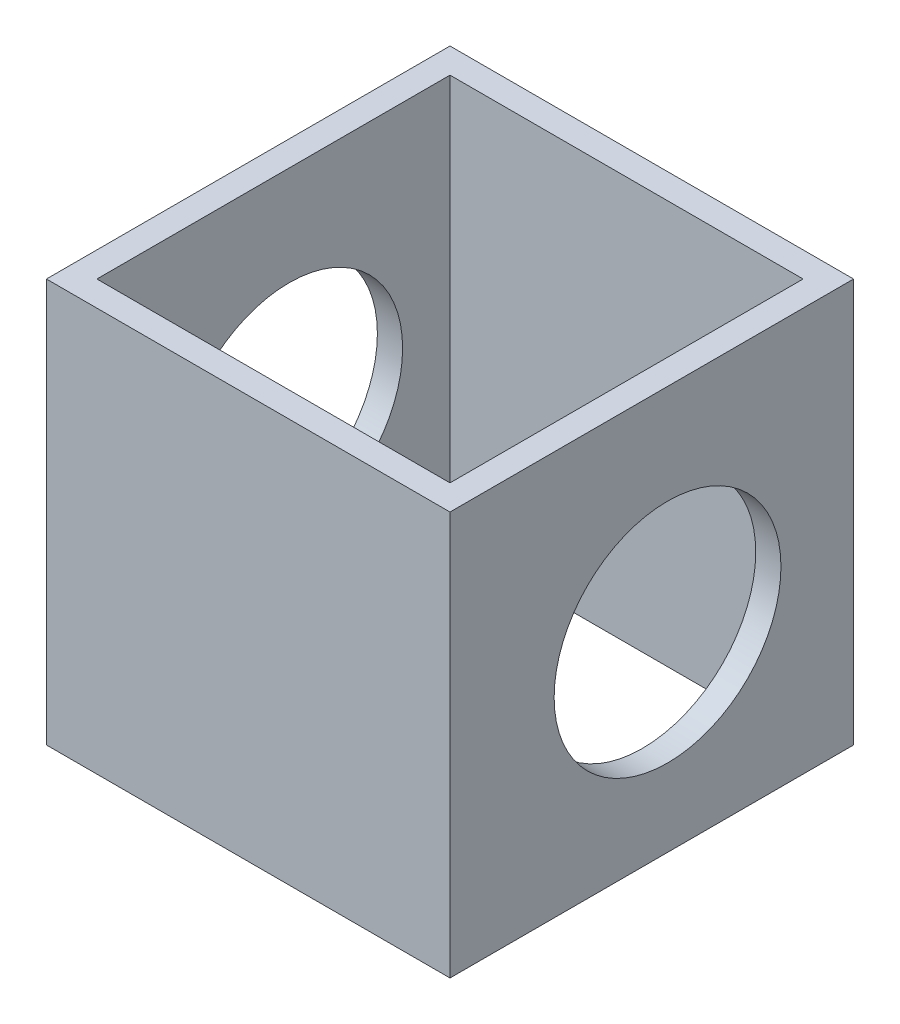
ISO-10303-21;
HEADER;
FILE_DESCRIPTION(('STEP AP214'),'2;1');
FILE_NAME('part.step','',(''),(''),'','','');
FILE_SCHEMA(('AUTOMOTIVE_DESIGN { 1 0 10303 214 1 1 1 1 }'));
ENDSEC;
DATA;
#1=APPLICATION_CONTEXT('core data for automotive mechanical design processes');
#2=APPLICATION_PROTOCOL_DEFINITION('international standard','automotive_design',2000,#1);
#3=PRODUCT_CONTEXT('',#1,'mechanical');
#4=PRODUCT('Part','Part','',(#3));
#5=PRODUCT_RELATED_PRODUCT_CATEGORY('part','',(#4));
#6=PRODUCT_DEFINITION_FORMATION('','',#4);
#7=PRODUCT_DEFINITION_CONTEXT('part definition',#1,'design');
#8=PRODUCT_DEFINITION('design','',#6,#7);
#9=PRODUCT_DEFINITION_SHAPE('','',#8);
#10=(LENGTH_UNIT() NAMED_UNIT(*) SI_UNIT(.MILLI.,.METRE.));
#11=(NAMED_UNIT(*) PLANE_ANGLE_UNIT() SI_UNIT($,.RADIAN.));
#12=(NAMED_UNIT(*) SI_UNIT($,.STERADIAN.) SOLID_ANGLE_UNIT());
#13=UNCERTAINTY_MEASURE_WITH_UNIT(LENGTH_MEASURE(1.E-05),#10,'distance_accuracy_value','');
#14=(GEOMETRIC_REPRESENTATION_CONTEXT(3) GLOBAL_UNCERTAINTY_ASSIGNED_CONTEXT((#13)) GLOBAL_UNIT_ASSIGNED_CONTEXT((#10,
#11,#12)) REPRESENTATION_CONTEXT('',''));
#15=CARTESIAN_POINT('',(0.,0.,0.));
#16=DIRECTION('',(0.,0.,1.));
#17=DIRECTION('',(1.,0.,0.));
#18=AXIS2_PLACEMENT_3D('',#15,#16,#17);
#19=CARTESIAN_POINT('',(0.,50.8,0.));
#20=DIRECTION('',(0.,1.,0.));
#21=DIRECTION('',(0.,0.,1.));
#22=AXIS2_PLACEMENT_3D('',#19,#20,#21);
#23=PLANE('',#22);
#24=DIRECTION('',(0.,0.,-1.));
#25=VECTOR('',#24,1.);
#26=CARTESIAN_POINT('',(25.4,50.8,25.4));
#27=LINE('',#26,#25);
#28=CARTESIAN_POINT('',(25.4,50.8,25.4));
#29=VERTEX_POINT('',#28);
#30=CARTESIAN_POINT('',(25.4,50.8,-25.4));
#31=VERTEX_POINT('',#30);
#32=EDGE_CURVE('E161',#29,#31,#27,.T.);
#33=ORIENTED_EDGE('',*,*,#32,.T.);
#34=DIRECTION('',(-1.,0.,0.));
#35=VECTOR('',#34,1.);
#36=CARTESIAN_POINT('',(-25.4,50.8,-25.4));
#37=LINE('',#36,#35);
#38=CARTESIAN_POINT('',(-25.4,50.8,-25.4));
#39=VERTEX_POINT('',#38);
#40=EDGE_CURVE('E164',#31,#39,#37,.T.);
#41=ORIENTED_EDGE('',*,*,#40,.T.);
#42=DIRECTION('',(0.,0.,1.));
#43=VECTOR('',#42,1.);
#44=CARTESIAN_POINT('',(-25.4,50.8,25.4));
#45=LINE('',#44,#43);
#46=CARTESIAN_POINT('',(-25.4,50.8,25.4));
#47=VERTEX_POINT('',#46);
#48=EDGE_CURVE('E167',#39,#47,#45,.T.);
#49=ORIENTED_EDGE('',*,*,#48,.T.);
#50=DIRECTION('',(1.,0.,0.));
#51=VECTOR('',#50,1.);
#52=CARTESIAN_POINT('',(-25.4,50.8,25.4));
#53=LINE('',#52,#51);
#54=EDGE_CURVE('E169',#47,#29,#53,.T.);
#55=ORIENTED_EDGE('',*,*,#54,.T.);
#56=EDGE_LOOP('',(#33,#41,#49,#55));
#57=FACE_BOUND('',#56,.T.);
#58=DIRECTION('',(-1.,0.,0.));
#59=VECTOR('',#58,1.);
#60=CARTESIAN_POINT('',(0.,50.8,-22.225));
#61=LINE('',#60,#59);
#62=CARTESIAN_POINT('',(22.225,50.8,-22.225));
#63=VERTEX_POINT('',#62);
#64=CARTESIAN_POINT('',(-22.225,50.8,-22.225));
#65=VERTEX_POINT('',#64);
#66=EDGE_CURVE('E131',#63,#65,#61,.T.);
#67=ORIENTED_EDGE('',*,*,#66,.F.);
#68=DIRECTION('',(0.,0.,-1.));
#69=VECTOR('',#68,1.);
#70=CARTESIAN_POINT('',(22.225,50.8,0.));
#71=LINE('',#70,#69);
#72=CARTESIAN_POINT('',(22.225,50.8,22.225));
#73=VERTEX_POINT('',#72);
#74=EDGE_CURVE('E123',#73,#63,#71,.T.);
#75=ORIENTED_EDGE('',*,*,#74,.F.);
#76=DIRECTION('',(1.,0.,0.));
#77=VECTOR('',#76,1.);
#78=CARTESIAN_POINT('',(0.,50.8,22.225));
#79=LINE('',#78,#77);
#80=CARTESIAN_POINT('',(-22.225,50.8,22.225));
#81=VERTEX_POINT('',#80);
#82=EDGE_CURVE('E145',#81,#73,#79,.T.);
#83=ORIENTED_EDGE('',*,*,#82,.F.);
#84=DIRECTION('',(0.,0.,1.));
#85=VECTOR('',#84,1.);
#86=CARTESIAN_POINT('',(-22.225,50.8,0.));
#87=LINE('',#86,#85);
#88=EDGE_CURVE('E143',#65,#81,#87,.T.);
#89=ORIENTED_EDGE('',*,*,#88,.F.);
#90=EDGE_LOOP('',(#67,#75,#83,#89));
#91=FACE_BOUND('',#90,.T.);
#92=ADVANCED_FACE('F57',(#57,#91),#23,.T.);
#93=CARTESIAN_POINT('',(0.,0.,0.));
#94=DIRECTION('',(0.,1.,0.));
#95=DIRECTION('',(0.,0.,1.));
#96=AXIS2_PLACEMENT_3D('',#93,#94,#95);
#97=PLANE('',#96);
#98=DIRECTION('',(0.,0.,-1.));
#99=VECTOR('',#98,1.);
#100=CARTESIAN_POINT('',(25.4,0.,25.4));
#101=LINE('',#100,#99);
#102=CARTESIAN_POINT('',(25.4,0.,25.4));
#103=VERTEX_POINT('',#102);
#104=CARTESIAN_POINT('',(25.4,0.,-25.4));
#105=VERTEX_POINT('',#104);
#106=EDGE_CURVE('E139',#103,#105,#101,.T.);
#107=ORIENTED_EDGE('',*,*,#106,.F.);
#108=DIRECTION('',(1.,0.,0.));
#109=VECTOR('',#108,1.);
#110=CARTESIAN_POINT('',(-25.4,0.,25.4));
#111=LINE('',#110,#109);
#112=CARTESIAN_POINT('',(-25.4,0.,25.4));
#113=VERTEX_POINT('',#112);
#114=EDGE_CURVE('E165',#113,#103,#111,.T.);
#115=ORIENTED_EDGE('',*,*,#114,.F.);
#116=DIRECTION('',(0.,0.,1.));
#117=VECTOR('',#116,1.);
#118=CARTESIAN_POINT('',(-25.4,0.,25.4));
#119=LINE('',#118,#117);
#120=CARTESIAN_POINT('',(-25.4,0.,-25.4));
#121=VERTEX_POINT('',#120);
#122=EDGE_CURVE('E176',#121,#113,#119,.T.);
#123=ORIENTED_EDGE('',*,*,#122,.F.);
#124=DIRECTION('',(-1.,0.,0.));
#125=VECTOR('',#124,1.);
#126=CARTESIAN_POINT('',(-25.4,0.,-25.4));
#127=LINE('',#126,#125);
#128=EDGE_CURVE('E174',#105,#121,#127,.T.);
#129=ORIENTED_EDGE('',*,*,#128,.F.);
#130=EDGE_LOOP('',(#107,#115,#123,#129));
#131=FACE_BOUND('',#130,.T.);
#132=DIRECTION('',(0.,0.,-1.));
#133=VECTOR('',#132,1.);
#134=CARTESIAN_POINT('',(22.225,0.,0.));
#135=LINE('',#134,#133);
#136=CARTESIAN_POINT('',(22.225,0.,22.225));
#137=VERTEX_POINT('',#136);
#138=CARTESIAN_POINT('',(22.225,0.,-22.225));
#139=VERTEX_POINT('',#138);
#140=EDGE_CURVE('E81',#137,#139,#135,.T.);
#141=ORIENTED_EDGE('',*,*,#140,.T.);
#142=DIRECTION('',(-1.,0.,0.));
#143=VECTOR('',#142,1.);
#144=CARTESIAN_POINT('',(0.,0.,-22.225));
#145=LINE('',#144,#143);
#146=CARTESIAN_POINT('',(-22.225,0.,-22.225));
#147=VERTEX_POINT('',#146);
#148=EDGE_CURVE('E138',#139,#147,#145,.T.);
#149=ORIENTED_EDGE('',*,*,#148,.T.);
#150=DIRECTION('',(0.,0.,1.));
#151=VECTOR('',#150,1.);
#152=CARTESIAN_POINT('',(-22.225,0.,0.));
#153=LINE('',#152,#151);
#154=CARTESIAN_POINT('',(-22.225,0.,22.225));
#155=VERTEX_POINT('',#154);
#156=EDGE_CURVE('E153',#147,#155,#153,.T.);
#157=ORIENTED_EDGE('',*,*,#156,.T.);
#158=DIRECTION('',(1.,0.,0.));
#159=VECTOR('',#158,1.);
#160=CARTESIAN_POINT('',(0.,0.,22.225));
#161=LINE('',#160,#159);
#162=EDGE_CURVE('E132',#155,#137,#161,.T.);
#163=ORIENTED_EDGE('',*,*,#162,.T.);
#164=EDGE_LOOP('',(#141,#149,#157,#163));
#165=FACE_BOUND('',#164,.T.);
#166=ADVANCED_FACE('F195',(#131,#165),#97,.F.);
#167=CARTESIAN_POINT('',(25.4,50.8,25.4));
#168=DIRECTION('',(-1.,0.,0.));
#169=DIRECTION('',(0.,0.,1.));
#170=AXIS2_PLACEMENT_3D('',#167,#168,#169);
#171=PLANE('',#170);
#172=CARTESIAN_POINT('',(25.4,24.0171117046661,-1.98418863327142));
#173=DIRECTION('',(1.,0.,0.));
#174=DIRECTION('',(0.,0.,-1.));
#175=AXIS2_PLACEMENT_3D('',#172,#173,#174);
#176=CIRCLE('',#175,14.2748);
#177=CARTESIAN_POINT('',(25.4,24.0171117046661,-16.2589886332714));
#178=VERTEX_POINT('',#177);
#179=EDGE_CURVE('E238',#178,#178,#176,.T.);
#180=ORIENTED_EDGE('',*,*,#179,.F.);
#181=EDGE_LOOP('',(#180));
#182=FACE_BOUND('',#181,.T.);
#183=ORIENTED_EDGE('',*,*,#106,.T.);
#184=DIRECTION('',(0.,-1.,0.));
#185=VECTOR('',#184,1.);
#186=CARTESIAN_POINT('',(25.4,50.8,-25.4));
#187=LINE('',#186,#185);
#188=EDGE_CURVE('E12',#31,#105,#187,.T.);
#189=ORIENTED_EDGE('',*,*,#188,.F.);
#190=ORIENTED_EDGE('',*,*,#32,.F.);
#191=DIRECTION('',(0.,-1.,0.));
#192=VECTOR('',#191,1.);
#193=CARTESIAN_POINT('',(25.4,50.8,25.4));
#194=LINE('',#193,#192);
#195=EDGE_CURVE('E171',#29,#103,#194,.T.);
#196=ORIENTED_EDGE('',*,*,#195,.T.);
#197=EDGE_LOOP('',(#183,#189,#190,#196));
#198=FACE_BOUND('',#197,.T.);
#199=ADVANCED_FACE('F59',(#182,#198),#171,.F.);
#200=CARTESIAN_POINT('',(-25.4,50.8,-25.4));
#201=DIRECTION('',(0.,0.,1.));
#202=DIRECTION('',(1.,0.,0.));
#203=AXIS2_PLACEMENT_3D('',#200,#201,#202);
#204=PLANE('',#203);
#205=ORIENTED_EDGE('',*,*,#128,.T.);
#206=DIRECTION('',(0.,-1.,0.));
#207=VECTOR('',#206,1.);
#208=CARTESIAN_POINT('',(-25.4,50.8,-25.4));
#209=LINE('',#208,#207);
#210=EDGE_CURVE('E66',#39,#121,#209,.T.);
#211=ORIENTED_EDGE('',*,*,#210,.F.);
#212=ORIENTED_EDGE('',*,*,#40,.F.);
#213=ORIENTED_EDGE('',*,*,#188,.T.);
#214=EDGE_LOOP('',(#205,#211,#212,#213));
#215=FACE_BOUND('',#214,.T.);
#216=ADVANCED_FACE('F205',(#215),#204,.F.);
#217=CARTESIAN_POINT('',(-25.4,50.8,25.4));
#218=DIRECTION('',(1.,0.,0.));
#219=DIRECTION('',(0.,0.,-1.));
#220=AXIS2_PLACEMENT_3D('',#217,#218,#219);
#221=PLANE('',#220);
#222=CARTESIAN_POINT('',(-25.4,24.0171117046661,-1.98418863327142));
#223=DIRECTION('',(1.,0.,0.));
#224=DIRECTION('',(0.,0.,-1.));
#225=AXIS2_PLACEMENT_3D('',#222,#223,#224);
#226=CIRCLE('',#225,14.2748);
#227=CARTESIAN_POINT('',(-25.4,24.0171117046661,-16.2589886332714));
#228=VERTEX_POINT('',#227);
#229=EDGE_CURVE('E236',#228,#228,#226,.T.);
#230=ORIENTED_EDGE('',*,*,#229,.T.);
#231=EDGE_LOOP('',(#230));
#232=FACE_BOUND('',#231,.T.);
#233=ORIENTED_EDGE('',*,*,#122,.T.);
#234=DIRECTION('',(0.,-1.,0.));
#235=VECTOR('',#234,1.);
#236=CARTESIAN_POINT('',(-25.4,50.8,25.4));
#237=LINE('',#236,#235);
#238=EDGE_CURVE('E181',#47,#113,#237,.T.);
#239=ORIENTED_EDGE('',*,*,#238,.F.);
#240=ORIENTED_EDGE('',*,*,#48,.F.);
#241=ORIENTED_EDGE('',*,*,#210,.T.);
#242=EDGE_LOOP('',(#233,#239,#240,#241));
#243=FACE_BOUND('',#242,.T.);
#244=ADVANCED_FACE('F189',(#232,#243),#221,.F.);
#245=CARTESIAN_POINT('',(-25.4,50.8,25.4));
#246=DIRECTION('',(0.,0.,-1.));
#247=DIRECTION('',(-1.,0.,0.));
#248=AXIS2_PLACEMENT_3D('',#245,#246,#247);
#249=PLANE('',#248);
#250=ORIENTED_EDGE('',*,*,#114,.T.);
#251=ORIENTED_EDGE('',*,*,#195,.F.);
#252=ORIENTED_EDGE('',*,*,#54,.F.);
#253=ORIENTED_EDGE('',*,*,#238,.T.);
#254=EDGE_LOOP('',(#250,#251,#252,#253));
#255=FACE_BOUND('',#254,.T.);
#256=ADVANCED_FACE('F199',(#255),#249,.F.);
#257=CARTESIAN_POINT('',(22.225,50.8,0.));
#258=DIRECTION('',(-1.,0.,0.));
#259=DIRECTION('',(0.,0.,1.));
#260=AXIS2_PLACEMENT_3D('',#257,#258,#259);
#261=PLANE('',#260);
#262=CARTESIAN_POINT('',(22.225,24.0171117046661,-1.98418863327142));
#263=DIRECTION('',(-1.,0.,0.));
#264=DIRECTION('',(0.,0.,1.));
#265=AXIS2_PLACEMENT_3D('',#262,#263,#264);
#266=CIRCLE('',#265,14.2748);
#267=CARTESIAN_POINT('',(22.225,24.0171117046661,12.2906113667286));
#268=VERTEX_POINT('',#267);
#269=EDGE_CURVE('E151',#268,#268,#266,.T.);
#270=ORIENTED_EDGE('',*,*,#269,.F.);
#271=EDGE_LOOP('',(#270));
#272=FACE_BOUND('',#271,.T.);
#273=ORIENTED_EDGE('',*,*,#140,.F.);
#274=DIRECTION('',(0.,-1.,0.));
#275=VECTOR('',#274,1.);
#276=CARTESIAN_POINT('',(22.225,50.8,22.225));
#277=LINE('',#276,#275);
#278=EDGE_CURVE('E127',#73,#137,#277,.T.);
#279=ORIENTED_EDGE('',*,*,#278,.F.);
#280=ORIENTED_EDGE('',*,*,#74,.T.);
#281=DIRECTION('',(0.,-1.,0.));
#282=VECTOR('',#281,1.);
#283=CARTESIAN_POINT('',(22.225,50.8,-22.225));
#284=LINE('',#283,#282);
#285=EDGE_CURVE('E126',#63,#139,#284,.T.);
#286=ORIENTED_EDGE('',*,*,#285,.T.);
#287=EDGE_LOOP('',(#273,#279,#280,#286));
#288=FACE_BOUND('',#287,.T.);
#289=ADVANCED_FACE('F125',(#272,#288),#261,.T.);
#290=CARTESIAN_POINT('',(0.,50.8,-22.225));
#291=DIRECTION('',(0.,0.,1.));
#292=DIRECTION('',(1.,0.,0.));
#293=AXIS2_PLACEMENT_3D('',#290,#291,#292);
#294=PLANE('',#293);
#295=ORIENTED_EDGE('',*,*,#148,.F.);
#296=ORIENTED_EDGE('',*,*,#285,.F.);
#297=ORIENTED_EDGE('',*,*,#66,.T.);
#298=DIRECTION('',(0.,-1.,0.));
#299=VECTOR('',#298,1.);
#300=CARTESIAN_POINT('',(-22.225,50.8,-22.225));
#301=LINE('',#300,#299);
#302=EDGE_CURVE('E140',#65,#147,#301,.T.);
#303=ORIENTED_EDGE('',*,*,#302,.T.);
#304=EDGE_LOOP('',(#295,#296,#297,#303));
#305=FACE_BOUND('',#304,.T.);
#306=ADVANCED_FACE('F135',(#305),#294,.T.);
#307=CARTESIAN_POINT('',(-22.225,50.8,0.));
#308=DIRECTION('',(1.,0.,0.));
#309=DIRECTION('',(0.,0.,-1.));
#310=AXIS2_PLACEMENT_3D('',#307,#308,#309);
#311=PLANE('',#310);
#312=CARTESIAN_POINT('',(-22.225,24.0171117046661,-1.98418863327142));
#313=DIRECTION('',(1.,0.,0.));
#314=DIRECTION('',(0.,0.,-1.));
#315=AXIS2_PLACEMENT_3D('',#312,#313,#314);
#316=CIRCLE('',#315,14.2748);
#317=CARTESIAN_POINT('',(-22.225,24.0171117046661,-16.2589886332714));
#318=VERTEX_POINT('',#317);
#319=EDGE_CURVE('E61',#318,#318,#316,.T.);
#320=ORIENTED_EDGE('',*,*,#319,.F.);
#321=EDGE_LOOP('',(#320));
#322=FACE_BOUND('',#321,.T.);
#323=ORIENTED_EDGE('',*,*,#156,.F.);
#324=ORIENTED_EDGE('',*,*,#302,.F.);
#325=ORIENTED_EDGE('',*,*,#88,.T.);
#326=DIRECTION('',(0.,-1.,0.));
#327=VECTOR('',#326,1.);
#328=CARTESIAN_POINT('',(-22.225,50.8,22.225));
#329=LINE('',#328,#327);
#330=EDGE_CURVE('E73',#81,#155,#329,.T.);
#331=ORIENTED_EDGE('',*,*,#330,.T.);
#332=EDGE_LOOP('',(#323,#324,#325,#331));
#333=FACE_BOUND('',#332,.T.);
#334=ADVANCED_FACE('F231',(#322,#333),#311,.T.);
#335=CARTESIAN_POINT('',(0.,50.8,22.225));
#336=DIRECTION('',(0.,0.,-1.));
#337=DIRECTION('',(-1.,0.,0.));
#338=AXIS2_PLACEMENT_3D('',#335,#336,#337);
#339=PLANE('',#338);
#340=ORIENTED_EDGE('',*,*,#162,.F.);
#341=ORIENTED_EDGE('',*,*,#330,.F.);
#342=ORIENTED_EDGE('',*,*,#82,.T.);
#343=ORIENTED_EDGE('',*,*,#278,.T.);
#344=EDGE_LOOP('',(#340,#341,#342,#343));
#345=FACE_BOUND('',#344,.T.);
#346=ADVANCED_FACE('F247',(#345),#339,.T.);
#347=CARTESIAN_POINT('',(-25.4,24.0171117046661,-1.98418863327142));
#348=DIRECTION('',(1.,0.,0.));
#349=DIRECTION('',(0.,0.,-1.));
#350=AXIS2_PLACEMENT_3D('',#347,#348,#349);
#351=CYLINDRICAL_SURFACE('',#350,14.2748);
#352=ORIENTED_EDGE('',*,*,#319,.T.);
#353=EDGE_LOOP('',(#352));
#354=FACE_BOUND('',#353,.T.);
#355=ORIENTED_EDGE('',*,*,#229,.F.);
#356=EDGE_LOOP('',(#355));
#357=FACE_BOUND('',#356,.T.);
#358=ADVANCED_FACE('F244',(#354,#357),#351,.F.);
#359=ORIENTED_EDGE('',*,*,#269,.T.);
#360=EDGE_LOOP('',(#359));
#361=FACE_BOUND('',#360,.T.);
#362=ORIENTED_EDGE('',*,*,#179,.T.);
#363=EDGE_LOOP('',(#362));
#364=FACE_BOUND('',#363,.T.);
#365=ADVANCED_FACE('F246',(#361,#364),#351,.F.);
#366=CLOSED_SHELL('',(#92,#166,#199,#216,#244,#256,#289,#306,#334,#346,#358,#365));
#367=MANIFOLD_SOLID_BREP('B2',#366);
#368=ADVANCED_BREP_SHAPE_REPRESENTATION('',(#18,#367),#14);
#369=SHAPE_DEFINITION_REPRESENTATION(#9,#368);
ENDSEC;
END-ISO-10303-21;
